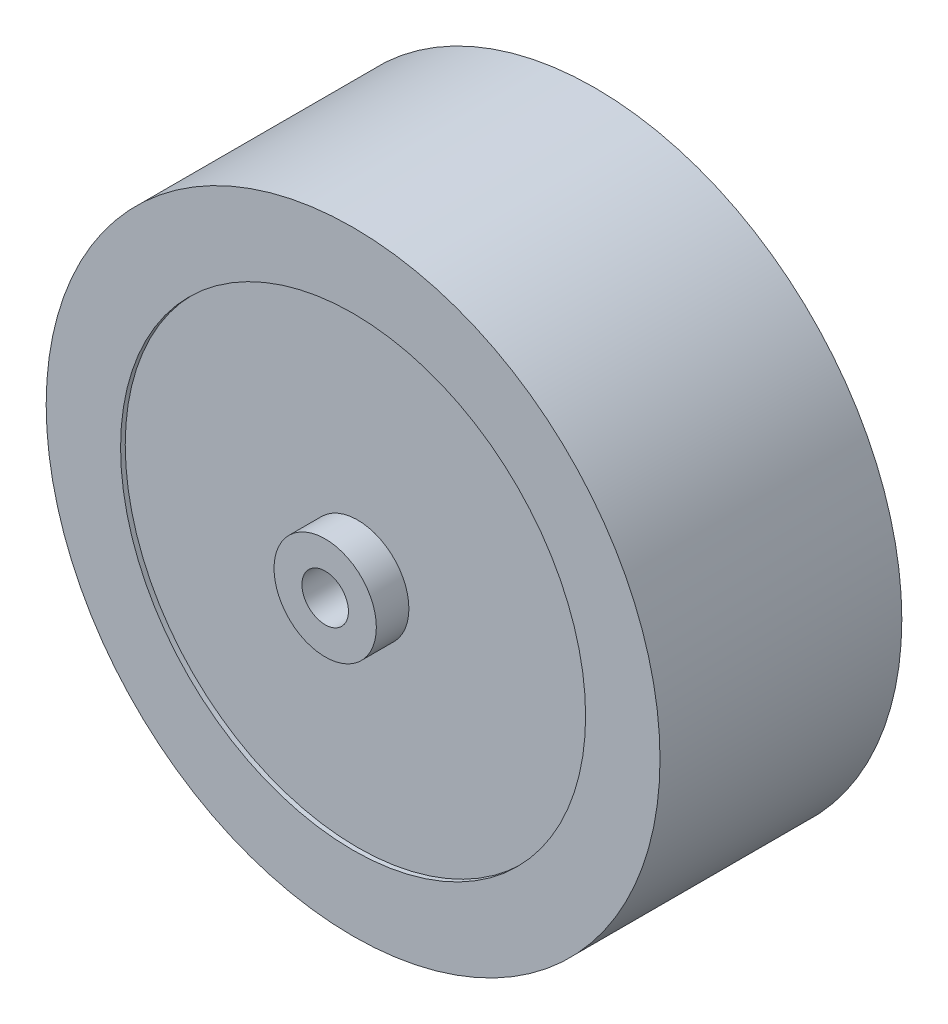
ISO-10303-21;
HEADER;
FILE_DESCRIPTION(('STEP AP214'),'2;1');
FILE_NAME('part.step','',(''),(''),'','','');
FILE_SCHEMA(('AUTOMOTIVE_DESIGN { 1 0 10303 214 1 1 1 1 }'));
ENDSEC;
DATA;
#1=APPLICATION_CONTEXT('core data for automotive mechanical design processes');
#2=APPLICATION_PROTOCOL_DEFINITION('international standard','automotive_design',2000,#1);
#3=PRODUCT_CONTEXT('',#1,'mechanical');
#4=PRODUCT('Part','Part','',(#3));
#5=PRODUCT_RELATED_PRODUCT_CATEGORY('part','',(#4));
#6=PRODUCT_DEFINITION_FORMATION('','',#4);
#7=PRODUCT_DEFINITION_CONTEXT('part definition',#1,'design');
#8=PRODUCT_DEFINITION('design','',#6,#7);
#9=PRODUCT_DEFINITION_SHAPE('','',#8);
#10=(LENGTH_UNIT() NAMED_UNIT(*) SI_UNIT(.MILLI.,.METRE.));
#11=(NAMED_UNIT(*) PLANE_ANGLE_UNIT() SI_UNIT($,.RADIAN.));
#12=(NAMED_UNIT(*) SI_UNIT($,.STERADIAN.) SOLID_ANGLE_UNIT());
#13=UNCERTAINTY_MEASURE_WITH_UNIT(LENGTH_MEASURE(1.E-05),#10,'distance_accuracy_value','');
#14=(GEOMETRIC_REPRESENTATION_CONTEXT(3) GLOBAL_UNCERTAINTY_ASSIGNED_CONTEXT((#13)) GLOBAL_UNIT_ASSIGNED_CONTEXT((#10,
#11,#12)) REPRESENTATION_CONTEXT('',''));
#15=CARTESIAN_POINT('',(0.,0.,0.));
#16=DIRECTION('',(0.,0.,1.));
#17=DIRECTION('',(1.,0.,0.));
#18=AXIS2_PLACEMENT_3D('',#15,#16,#17);
#19=CARTESIAN_POINT('',(0.,0.,-13.));
#20=DIRECTION('',(0.,0.,1.));
#21=DIRECTION('',(1.,0.,0.));
#22=AXIS2_PLACEMENT_3D('',#19,#20,#21);
#23=CYLINDRICAL_SURFACE('',#22,25.);
#24=CARTESIAN_POINT('',(0.,0.,-13.));
#25=DIRECTION('',(0.,0.,1.));
#26=DIRECTION('',(1.,0.,0.));
#27=AXIS2_PLACEMENT_3D('',#24,#25,#26);
#28=CIRCLE('',#27,25.);
#29=CARTESIAN_POINT('',(25.,0.,-13.));
#30=VERTEX_POINT('',#29);
#31=EDGE_CURVE('E50',#30,#30,#28,.T.);
#32=ORIENTED_EDGE('',*,*,#31,.F.);
#33=EDGE_LOOP('',(#32));
#34=FACE_BOUND('',#33,.T.);
#35=CARTESIAN_POINT('',(0.,0.,-12.5));
#36=DIRECTION('',(0.,0.,1.));
#37=DIRECTION('',(1.,0.,0.));
#38=AXIS2_PLACEMENT_3D('',#35,#36,#37);
#39=CIRCLE('',#38,25.);
#40=CARTESIAN_POINT('',(25.,0.,-12.5));
#41=VERTEX_POINT('',#40);
#42=EDGE_CURVE('E10',#41,#41,#39,.F.);
#43=ORIENTED_EDGE('',*,*,#42,.F.);
#44=EDGE_LOOP('',(#43));
#45=FACE_BOUND('',#44,.T.);
#46=ADVANCED_FACE('F39',(#34,#45),#23,.F.);
#47=CARTESIAN_POINT('',(0.,0.,12.5));
#48=DIRECTION('',(0.,0.,1.));
#49=DIRECTION('',(1.,0.,0.));
#50=AXIS2_PLACEMENT_3D('',#47,#48,#49);
#51=CIRCLE('',#50,25.);
#52=CARTESIAN_POINT('',(25.,0.,12.5));
#53=VERTEX_POINT('',#52);
#54=EDGE_CURVE('E65',#53,#53,#51,.T.);
#55=ORIENTED_EDGE('',*,*,#54,.F.);
#56=EDGE_LOOP('',(#55));
#57=FACE_BOUND('',#56,.T.);
#58=CARTESIAN_POINT('',(0.,0.,13.));
#59=DIRECTION('',(0.,0.,1.));
#60=DIRECTION('',(1.,0.,0.));
#61=AXIS2_PLACEMENT_3D('',#58,#59,#60);
#62=CIRCLE('',#61,25.);
#63=CARTESIAN_POINT('',(25.,0.,13.));
#64=VERTEX_POINT('',#63);
#65=EDGE_CURVE('E59',#64,#64,#62,.T.);
#66=ORIENTED_EDGE('',*,*,#65,.T.);
#67=EDGE_LOOP('',(#66));
#68=FACE_BOUND('',#67,.T.);
#69=ADVANCED_FACE('F41',(#57,#68),#23,.F.);
#70=CARTESIAN_POINT('',(0.,0.,-13.));
#71=DIRECTION('',(0.,0.,1.));
#72=DIRECTION('',(1.,0.,0.));
#73=AXIS2_PLACEMENT_3D('',#70,#71,#72);
#74=CYLINDRICAL_SURFACE('',#73,33.);
#75=CARTESIAN_POINT('',(0.,0.,-13.));
#76=DIRECTION('',(0.,0.,1.));
#77=DIRECTION('',(1.,0.,0.));
#78=AXIS2_PLACEMENT_3D('',#75,#76,#77);
#79=CIRCLE('',#78,33.);
#80=CARTESIAN_POINT('',(33.,0.,-13.));
#81=VERTEX_POINT('',#80);
#82=EDGE_CURVE('E46',#81,#81,#79,.T.);
#83=ORIENTED_EDGE('',*,*,#82,.T.);
#84=EDGE_LOOP('',(#83));
#85=FACE_BOUND('',#84,.T.);
#86=CARTESIAN_POINT('',(0.,0.,13.));
#87=DIRECTION('',(0.,0.,1.));
#88=DIRECTION('',(1.,0.,0.));
#89=AXIS2_PLACEMENT_3D('',#86,#87,#88);
#90=CIRCLE('',#89,33.);
#91=CARTESIAN_POINT('',(33.,0.,13.));
#92=VERTEX_POINT('',#91);
#93=EDGE_CURVE('E54',#92,#92,#90,.T.);
#94=ORIENTED_EDGE('',*,*,#93,.F.);
#95=EDGE_LOOP('',(#94));
#96=FACE_BOUND('',#95,.T.);
#97=ADVANCED_FACE('F103',(#85,#96),#74,.T.);
#98=CARTESIAN_POINT('',(0.,0.,-13.));
#99=DIRECTION('',(0.,0.,1.));
#100=DIRECTION('',(1.,0.,0.));
#101=AXIS2_PLACEMENT_3D('',#98,#99,#100);
#102=PLANE('',#101);
#103=ORIENTED_EDGE('',*,*,#31,.T.);
#104=EDGE_LOOP('',(#103));
#105=FACE_BOUND('',#104,.T.);
#106=ORIENTED_EDGE('',*,*,#82,.F.);
#107=EDGE_LOOP('',(#106));
#108=FACE_BOUND('',#107,.T.);
#109=ADVANCED_FACE('F94',(#105,#108),#102,.F.);
#110=CARTESIAN_POINT('',(0.,0.,13.));
#111=DIRECTION('',(0.,0.,1.));
#112=DIRECTION('',(1.,0.,0.));
#113=AXIS2_PLACEMENT_3D('',#110,#111,#112);
#114=PLANE('',#113);
#115=ORIENTED_EDGE('',*,*,#65,.F.);
#116=EDGE_LOOP('',(#115));
#117=FACE_BOUND('',#116,.T.);
#118=ORIENTED_EDGE('',*,*,#93,.T.);
#119=EDGE_LOOP('',(#118));
#120=FACE_BOUND('',#119,.T.);
#121=ADVANCED_FACE('F84',(#117,#120),#114,.T.);
#122=CARTESIAN_POINT('',(0.,0.,-12.5));
#123=DIRECTION('',(0.,0.,1.));
#124=DIRECTION('',(1.,0.,0.));
#125=AXIS2_PLACEMENT_3D('',#122,#123,#124);
#126=CYLINDRICAL_SURFACE('',#125,2.5);
#127=CARTESIAN_POINT('',(0.,0.,-12.5));
#128=DIRECTION('',(0.,0.,1.));
#129=DIRECTION('',(1.,0.,0.));
#130=AXIS2_PLACEMENT_3D('',#127,#128,#129);
#131=CIRCLE('',#130,2.5);
#132=CARTESIAN_POINT('',(2.5,0.,-12.5));
#133=VERTEX_POINT('',#132);
#134=EDGE_CURVE('E62',#133,#133,#131,.T.);
#135=ORIENTED_EDGE('',*,*,#134,.F.);
#136=EDGE_LOOP('',(#135));
#137=FACE_BOUND('',#136,.T.);
#138=CARTESIAN_POINT('',(0.,0.,16.));
#139=DIRECTION('',(0.,0.,1.));
#140=DIRECTION('',(1.,0.,0.));
#141=AXIS2_PLACEMENT_3D('',#138,#139,#140);
#142=CIRCLE('',#141,2.5);
#143=CARTESIAN_POINT('',(2.5,0.,16.));
#144=VERTEX_POINT('',#143);
#145=EDGE_CURVE('E72',#144,#144,#142,.F.);
#146=ORIENTED_EDGE('',*,*,#145,.F.);
#147=EDGE_LOOP('',(#146));
#148=FACE_BOUND('',#147,.T.);
#149=ADVANCED_FACE('F81',(#137,#148),#126,.F.);
#150=CARTESIAN_POINT('',(0.,0.,-12.5));
#151=DIRECTION('',(0.,0.,1.));
#152=DIRECTION('',(1.,0.,0.));
#153=AXIS2_PLACEMENT_3D('',#150,#151,#152);
#154=PLANE('',#153);
#155=ORIENTED_EDGE('',*,*,#134,.T.);
#156=EDGE_LOOP('',(#155));
#157=FACE_BOUND('',#156,.T.);
#158=ORIENTED_EDGE('',*,*,#42,.T.);
#159=EDGE_LOOP('',(#158));
#160=FACE_BOUND('',#159,.T.);
#161=ADVANCED_FACE('F83',(#157,#160),#154,.F.);
#162=CARTESIAN_POINT('',(0.,0.,12.5));
#163=DIRECTION('',(0.,0.,1.));
#164=DIRECTION('',(1.,0.,0.));
#165=AXIS2_PLACEMENT_3D('',#162,#163,#164);
#166=PLANE('',#165);
#167=CARTESIAN_POINT('',(0.,0.,12.5));
#168=DIRECTION('',(0.,0.,1.));
#169=DIRECTION('',(1.,0.,0.));
#170=AXIS2_PLACEMENT_3D('',#167,#168,#169);
#171=CIRCLE('',#170,5.5);
#172=CARTESIAN_POINT('',(5.5,0.,12.5));
#173=VERTEX_POINT('',#172);
#174=EDGE_CURVE('E69',#173,#173,#171,.T.);
#175=ORIENTED_EDGE('',*,*,#174,.F.);
#176=EDGE_LOOP('',(#175));
#177=FACE_BOUND('',#176,.T.);
#178=ORIENTED_EDGE('',*,*,#54,.T.);
#179=EDGE_LOOP('',(#178));
#180=FACE_BOUND('',#179,.T.);
#181=ADVANCED_FACE('F91',(#177,#180),#166,.T.);
#182=CARTESIAN_POINT('',(0.,0.,16.));
#183=DIRECTION('',(0.,0.,-1.));
#184=DIRECTION('',(-1.,0.,0.));
#185=AXIS2_PLACEMENT_3D('',#182,#183,#184);
#186=CYLINDRICAL_SURFACE('',#185,5.5);
#187=CARTESIAN_POINT('',(0.,0.,16.));
#188=DIRECTION('',(0.,0.,1.));
#189=DIRECTION('',(1.,0.,0.));
#190=AXIS2_PLACEMENT_3D('',#187,#188,#189);
#191=CIRCLE('',#190,5.5);
#192=CARTESIAN_POINT('',(5.5,0.,16.));
#193=VERTEX_POINT('',#192);
#194=EDGE_CURVE('E68',#193,#193,#191,.T.);
#195=ORIENTED_EDGE('',*,*,#194,.F.);
#196=EDGE_LOOP('',(#195));
#197=FACE_BOUND('',#196,.T.);
#198=ORIENTED_EDGE('',*,*,#174,.T.);
#199=EDGE_LOOP('',(#198));
#200=FACE_BOUND('',#199,.T.);
#201=ADVANCED_FACE('F149',(#197,#200),#186,.T.);
#202=CARTESIAN_POINT('',(0.,0.,16.));
#203=DIRECTION('',(0.,0.,1.));
#204=DIRECTION('',(1.,0.,0.));
#205=AXIS2_PLACEMENT_3D('',#202,#203,#204);
#206=PLANE('',#205);
#207=ORIENTED_EDGE('',*,*,#145,.T.);
#208=EDGE_LOOP('',(#207));
#209=FACE_BOUND('',#208,.T.);
#210=ORIENTED_EDGE('',*,*,#194,.T.);
#211=EDGE_LOOP('',(#210));
#212=FACE_BOUND('',#211,.T.);
#213=ADVANCED_FACE('F78',(#209,#212),#206,.T.);
#214=CLOSED_SHELL('',(#46,#69,#97,#109,#121,#149,#161,#181,#201,#213));
#215=MANIFOLD_SOLID_BREP('B2',#214);
#216=ADVANCED_BREP_SHAPE_REPRESENTATION('',(#18,#215),#14);
#217=SHAPE_DEFINITION_REPRESENTATION(#9,#216);
ENDSEC;
END-ISO-10303-21;
